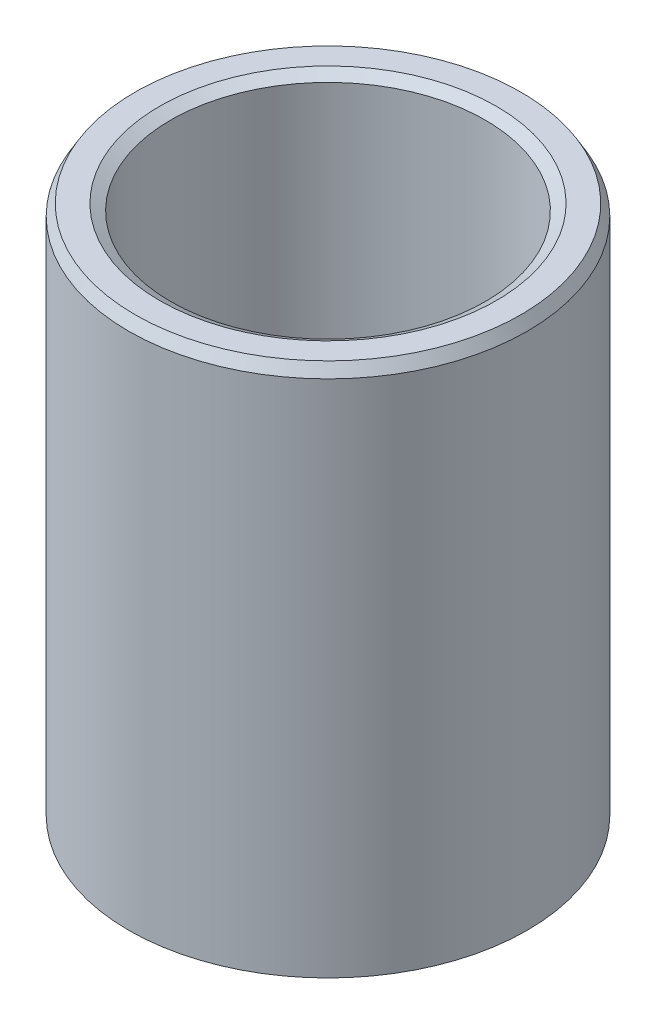
ISO-10303-21;
HEADER;
FILE_DESCRIPTION(('STEP AP214'),'2;1');
FILE_NAME('part.step','',(''),(''),'','','');
FILE_SCHEMA(('AUTOMOTIVE_DESIGN { 1 0 10303 214 1 1 1 1 }'));
ENDSEC;
DATA;
#1=APPLICATION_CONTEXT('core data for automotive mechanical design processes');
#2=APPLICATION_PROTOCOL_DEFINITION('international standard','automotive_design',2000,#1);
#3=PRODUCT_CONTEXT('',#1,'mechanical');
#4=PRODUCT('Part','Part','',(#3));
#5=PRODUCT_RELATED_PRODUCT_CATEGORY('part','',(#4));
#6=PRODUCT_DEFINITION_FORMATION('','',#4);
#7=PRODUCT_DEFINITION_CONTEXT('part definition',#1,'design');
#8=PRODUCT_DEFINITION('design','',#6,#7);
#9=PRODUCT_DEFINITION_SHAPE('','',#8);
#10=(LENGTH_UNIT() NAMED_UNIT(*) SI_UNIT(.MILLI.,.METRE.));
#11=(NAMED_UNIT(*) PLANE_ANGLE_UNIT() SI_UNIT($,.RADIAN.));
#12=(NAMED_UNIT(*) SI_UNIT($,.STERADIAN.) SOLID_ANGLE_UNIT());
#13=UNCERTAINTY_MEASURE_WITH_UNIT(LENGTH_MEASURE(1.E-05),#10,'distance_accuracy_value','');
#14=(GEOMETRIC_REPRESENTATION_CONTEXT(3) GLOBAL_UNCERTAINTY_ASSIGNED_CONTEXT((#13)) GLOBAL_UNIT_ASSIGNED_CONTEXT((#10,
#11,#12)) REPRESENTATION_CONTEXT('',''));
#15=CARTESIAN_POINT('',(0.,0.,0.));
#16=DIRECTION('',(0.,0.,1.));
#17=DIRECTION('',(1.,0.,0.));
#18=AXIS2_PLACEMENT_3D('',#15,#16,#17);
#19=CARTESIAN_POINT('',(0.,127.836191744714,0.));
#20=DIRECTION('',(0.,-1.,0.));
#21=DIRECTION('',(0.,0.,-1.));
#22=AXIS2_PLACEMENT_3D('',#19,#20,#21);
#23=CYLINDRICAL_SURFACE('',#22,47.5);
#24=CARTESIAN_POINT('',(0.,1.5251308099411,0.));
#25=DIRECTION('',(0.,1.,0.));
#26=DIRECTION('',(0.,0.,1.));
#27=AXIS2_PLACEMENT_3D('',#24,#25,#26);
#28=CIRCLE('',#27,47.5);
#29=CARTESIAN_POINT('',(0.,1.5251308099411,47.5));
#30=VERTEX_POINT('',#29);
#31=EDGE_CURVE('E10',#30,#30,#28,.T.);
#32=ORIENTED_EDGE('',*,*,#31,.T.);
#33=EDGE_LOOP('',(#32));
#34=FACE_BOUND('',#33,.T.);
#35=CARTESIAN_POINT('',(0.,125.194587693707,0.));
#36=DIRECTION('',(0.,1.,0.));
#37=DIRECTION('',(0.,0.,1.));
#38=AXIS2_PLACEMENT_3D('',#35,#36,#37);
#39=CIRCLE('',#38,47.5);
#40=CARTESIAN_POINT('',(0.,125.194587693707,47.5));
#41=VERTEX_POINT('',#40);
#42=EDGE_CURVE('E50',#41,#41,#39,.F.);
#43=ORIENTED_EDGE('',*,*,#42,.T.);
#44=EDGE_LOOP('',(#43));
#45=FACE_BOUND('',#44,.T.);
#46=ADVANCED_FACE('F39',(#34,#45),#23,.T.);
#47=CARTESIAN_POINT('',(0.,127.836191744714,0.));
#48=DIRECTION('',(0.,1.,0.));
#49=DIRECTION('',(0.,0.,1.));
#50=AXIS2_PLACEMENT_3D('',#47,#48,#49);
#51=PLANE('',#50);
#52=CARTESIAN_POINT('',(0.,127.836191744714,0.));
#53=DIRECTION('',(0.,1.,0.));
#54=DIRECTION('',(0.,0.,1.));
#55=AXIS2_PLACEMENT_3D('',#52,#53,#54);
#56=CIRCLE('',#55,40.1318504406846);
#57=CARTESIAN_POINT('',(0.,127.836191744714,40.1318504406846));
#58=VERTEX_POINT('',#57);
#59=EDGE_CURVE('E58',#58,#58,#56,.F.);
#60=ORIENTED_EDGE('',*,*,#59,.T.);
#61=EDGE_LOOP('',(#60));
#62=FACE_BOUND('',#61,.T.);
#63=CARTESIAN_POINT('',(0.,127.836191744714,0.));
#64=DIRECTION('',(0.,1.,0.));
#65=DIRECTION('',(0.,0.,1.));
#66=AXIS2_PLACEMENT_3D('',#63,#64,#65);
#67=CIRCLE('',#66,45.9748691900589);
#68=CARTESIAN_POINT('',(0.,127.836191744714,45.9748691900589));
#69=VERTEX_POINT('',#68);
#70=EDGE_CURVE('E61',#69,#69,#67,.T.);
#71=ORIENTED_EDGE('',*,*,#70,.T.);
#72=EDGE_LOOP('',(#71));
#73=FACE_BOUND('',#72,.T.);
#74=ADVANCED_FACE('F88',(#62,#73),#51,.T.);
#75=CARTESIAN_POINT('',(0.,0.,0.));
#76=DIRECTION('',(0.,1.,0.));
#77=DIRECTION('',(0.,0.,1.));
#78=AXIS2_PLACEMENT_3D('',#75,#76,#77);
#79=PLANE('',#78);
#80=CARTESIAN_POINT('',(0.,0.,0.));
#81=DIRECTION('',(0.,1.,0.));
#82=DIRECTION('',(0.,0.,1.));
#83=AXIS2_PLACEMENT_3D('',#80,#81,#82);
#84=CIRCLE('',#83,39.015377199619);
#85=CARTESIAN_POINT('',(0.,0.,39.015377199619));
#86=VERTEX_POINT('',#85);
#87=EDGE_CURVE('E51',#86,#86,#84,.T.);
#88=ORIENTED_EDGE('',*,*,#87,.T.);
#89=EDGE_LOOP('',(#88));
#90=FACE_BOUND('',#89,.T.);
#91=CARTESIAN_POINT('',(0.,0.,0.));
#92=DIRECTION('',(0.,1.,0.));
#93=DIRECTION('',(0.,0.,1.));
#94=AXIS2_PLACEMENT_3D('',#91,#92,#93);
#95=CIRCLE('',#94,44.8583959489933);
#96=CARTESIAN_POINT('',(0.,0.,44.8583959489933));
#97=VERTEX_POINT('',#96);
#98=EDGE_CURVE('E54',#97,#97,#95,.F.);
#99=ORIENTED_EDGE('',*,*,#98,.T.);
#100=EDGE_LOOP('',(#99));
#101=FACE_BOUND('',#100,.T.);
#102=ADVANCED_FACE('F83',(#90,#101),#79,.F.);
#103=CARTESIAN_POINT('',(0.,127.836191744714,0.));
#104=DIRECTION('',(0.,-1.,0.));
#105=DIRECTION('',(0.,0.,-1.));
#106=AXIS2_PLACEMENT_3D('',#103,#104,#105);
#107=CYLINDRICAL_SURFACE('',#106,37.4902463896779);
#108=CARTESIAN_POINT('',(0.,126.311060934773,0.));
#109=DIRECTION('',(0.,1.,0.));
#110=DIRECTION('',(0.,0.,1.));
#111=AXIS2_PLACEMENT_3D('',#108,#109,#110);
#112=CIRCLE('',#111,37.4902463896779);
#113=CARTESIAN_POINT('',(0.,126.311060934773,37.4902463896779));
#114=VERTEX_POINT('',#113);
#115=EDGE_CURVE('E67',#114,#114,#112,.T.);
#116=ORIENTED_EDGE('',*,*,#115,.T.);
#117=EDGE_LOOP('',(#116));
#118=FACE_BOUND('',#117,.T.);
#119=CARTESIAN_POINT('',(0.,2.64160405100669,0.));
#120=DIRECTION('',(0.,1.,0.));
#121=DIRECTION('',(0.,0.,1.));
#122=AXIS2_PLACEMENT_3D('',#119,#120,#121);
#123=CIRCLE('',#122,37.4902463896779);
#124=CARTESIAN_POINT('',(0.,2.64160405100669,37.4902463896779));
#125=VERTEX_POINT('',#124);
#126=EDGE_CURVE('E69',#125,#125,#123,.F.);
#127=ORIENTED_EDGE('',*,*,#126,.T.);
#128=EDGE_LOOP('',(#127));
#129=FACE_BOUND('',#128,.T.);
#130=ADVANCED_FACE('F71',(#118,#129),#107,.F.);
#131=CARTESIAN_POINT('',(0.,126.311060934773,0.));
#132=DIRECTION('',(0.,1.,0.));
#133=DIRECTION('',(0.,0.,1.));
#134=AXIS2_PLACEMENT_3D('',#131,#132,#133);
#135=CONICAL_SURFACE('',#134,37.4902463896779,1.0471975511966);
#136=ORIENTED_EDGE('',*,*,#59,.F.);
#137=EDGE_LOOP('',(#136));
#138=FACE_BOUND('',#137,.T.);
#139=ORIENTED_EDGE('',*,*,#115,.F.);
#140=EDGE_LOOP('',(#139));
#141=FACE_BOUND('',#140,.T.);
#142=ADVANCED_FACE('F77',(#138,#141),#135,.F.);
#143=CARTESIAN_POINT('',(0.,0.,0.));
#144=DIRECTION('',(0.,-1.,0.));
#145=DIRECTION('',(0.,0.,-1.));
#146=AXIS2_PLACEMENT_3D('',#143,#144,#145);
#147=CONICAL_SURFACE('',#146,39.015377199619,0.523598775598289);
#148=ORIENTED_EDGE('',*,*,#126,.F.);
#149=EDGE_LOOP('',(#148));
#150=FACE_BOUND('',#149,.T.);
#151=ORIENTED_EDGE('',*,*,#87,.F.);
#152=EDGE_LOOP('',(#151));
#153=FACE_BOUND('',#152,.T.);
#154=ADVANCED_FACE('F73',(#150,#153),#147,.F.);
#155=CARTESIAN_POINT('',(0.,1.5251308099411,0.));
#156=DIRECTION('',(0.,1.,0.));
#157=DIRECTION('',(0.,0.,1.));
#158=AXIS2_PLACEMENT_3D('',#155,#156,#157);
#159=CONICAL_SURFACE('',#158,47.5,1.0471975511966);
#160=ORIENTED_EDGE('',*,*,#98,.F.);
#161=EDGE_LOOP('',(#160));
#162=FACE_BOUND('',#161,.T.);
#163=ORIENTED_EDGE('',*,*,#31,.F.);
#164=EDGE_LOOP('',(#163));
#165=FACE_BOUND('',#164,.T.);
#166=ADVANCED_FACE('F76',(#162,#165),#159,.T.);
#167=CARTESIAN_POINT('',(0.,127.836191744714,0.));
#168=DIRECTION('',(0.,-1.,0.));
#169=DIRECTION('',(0.,0.,-1.));
#170=AXIS2_PLACEMENT_3D('',#167,#168,#169);
#171=CONICAL_SURFACE('',#170,45.9748691900589,0.523598775598294);
#172=ORIENTED_EDGE('',*,*,#42,.F.);
#173=EDGE_LOOP('',(#172));
#174=FACE_BOUND('',#173,.T.);
#175=ORIENTED_EDGE('',*,*,#70,.F.);
#176=EDGE_LOOP('',(#175));
#177=FACE_BOUND('',#176,.T.);
#178=ADVANCED_FACE('F45',(#174,#177),#171,.T.);
#179=CLOSED_SHELL('',(#46,#74,#102,#130,#142,#154,#166,#178));
#180=MANIFOLD_SOLID_BREP('B2',#179);
#181=ADVANCED_BREP_SHAPE_REPRESENTATION('',(#18,#180),#14);
#182=SHAPE_DEFINITION_REPRESENTATION(#9,#181);
ENDSEC;
END-ISO-10303-21;
